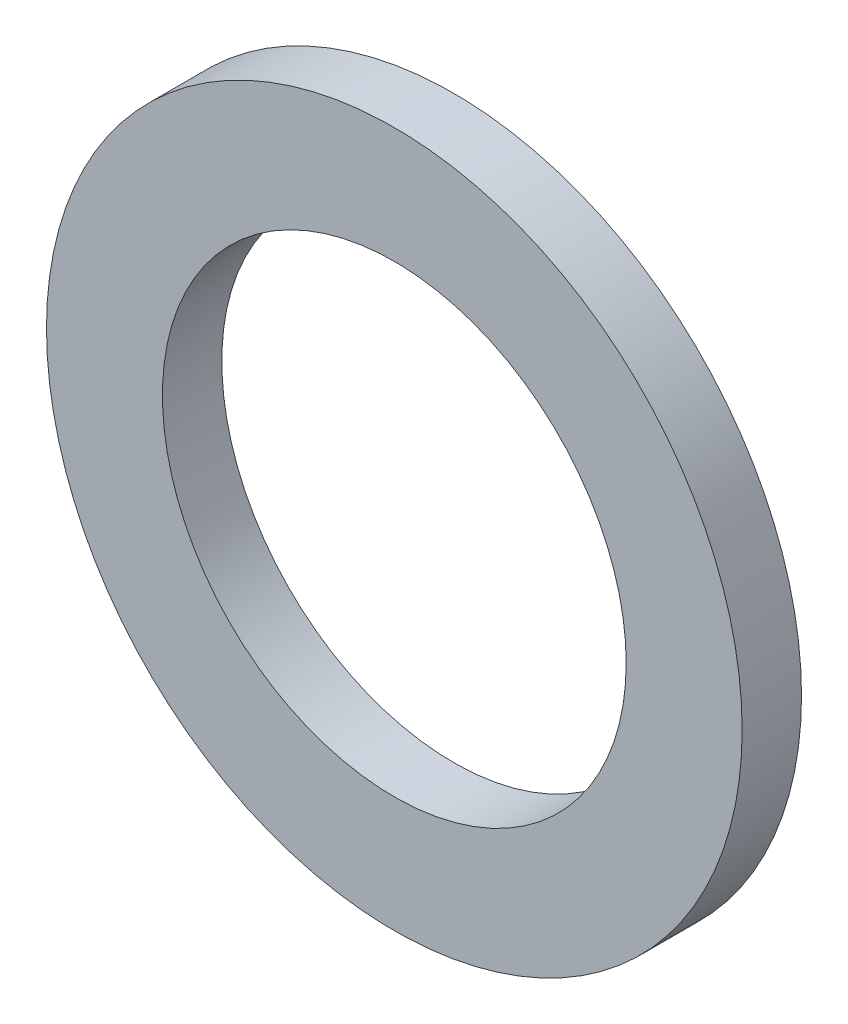
ISO-10303-21;
HEADER;
FILE_DESCRIPTION(('STEP AP214'),'2;1');
FILE_NAME('part.step','',(''),(''),'','','');
FILE_SCHEMA(('AUTOMOTIVE_DESIGN { 1 0 10303 214 1 1 1 1 }'));
ENDSEC;
DATA;
#1=APPLICATION_CONTEXT('core data for automotive mechanical design processes');
#2=APPLICATION_PROTOCOL_DEFINITION('international standard','automotive_design',2000,#1);
#3=PRODUCT_CONTEXT('',#1,'mechanical');
#4=PRODUCT('Part','Part','',(#3));
#5=PRODUCT_RELATED_PRODUCT_CATEGORY('part','',(#4));
#6=PRODUCT_DEFINITION_FORMATION('','',#4);
#7=PRODUCT_DEFINITION_CONTEXT('part definition',#1,'design');
#8=PRODUCT_DEFINITION('design','',#6,#7);
#9=PRODUCT_DEFINITION_SHAPE('','',#8);
#10=(LENGTH_UNIT() NAMED_UNIT(*) SI_UNIT(.MILLI.,.METRE.));
#11=(NAMED_UNIT(*) PLANE_ANGLE_UNIT() SI_UNIT($,.RADIAN.));
#12=(NAMED_UNIT(*) SI_UNIT($,.STERADIAN.) SOLID_ANGLE_UNIT());
#13=UNCERTAINTY_MEASURE_WITH_UNIT(LENGTH_MEASURE(1.E-05),#10,'distance_accuracy_value','');
#14=(GEOMETRIC_REPRESENTATION_CONTEXT(3) GLOBAL_UNCERTAINTY_ASSIGNED_CONTEXT((#13)) GLOBAL_UNIT_ASSIGNED_CONTEXT((#10,
#11,#12)) REPRESENTATION_CONTEXT('',''));
#15=CARTESIAN_POINT('',(0.,0.,0.));
#16=DIRECTION('',(0.,0.,1.));
#17=DIRECTION('',(1.,0.,0.));
#18=AXIS2_PLACEMENT_3D('',#15,#16,#17);
#19=CARTESIAN_POINT('',(0.,0.,0.2032));
#20=DIRECTION('',(0.,0.,1.));
#21=DIRECTION('',(1.,0.,0.));
#22=AXIS2_PLACEMENT_3D('',#19,#20,#21);
#23=PLANE('',#22);
#24=CARTESIAN_POINT('',(0.,0.,0.2032));
#25=DIRECTION('',(0.,0.,1.));
#26=DIRECTION('',(1.,0.,0.));
#27=AXIS2_PLACEMENT_3D('',#24,#25,#26);
#28=CIRCLE('',#27,2.38125);
#29=CARTESIAN_POINT('',(2.38125,0.,0.2032));
#30=VERTEX_POINT('',#29);
#31=EDGE_CURVE('E10',#30,#30,#28,.T.);
#32=ORIENTED_EDGE('',*,*,#31,.T.);
#33=EDGE_LOOP('',(#32));
#34=FACE_BOUND('',#33,.T.);
#35=CARTESIAN_POINT('',(0.,0.,0.2032));
#36=DIRECTION('',(0.,0.,1.));
#37=DIRECTION('',(1.,0.,0.));
#38=AXIS2_PLACEMENT_3D('',#35,#36,#37);
#39=CIRCLE('',#38,1.5875);
#40=CARTESIAN_POINT('',(1.5875,0.,0.2032));
#41=VERTEX_POINT('',#40);
#42=EDGE_CURVE('E46',#41,#41,#39,.T.);
#43=ORIENTED_EDGE('',*,*,#42,.F.);
#44=EDGE_LOOP('',(#43));
#45=FACE_BOUND('',#44,.T.);
#46=ADVANCED_FACE('F35',(#34,#45),#23,.T.);
#47=CARTESIAN_POINT('',(0.,0.,-0.2032));
#48=DIRECTION('',(0.,0.,1.));
#49=DIRECTION('',(1.,0.,0.));
#50=AXIS2_PLACEMENT_3D('',#47,#48,#49);
#51=PLANE('',#50);
#52=CARTESIAN_POINT('',(0.,0.,-0.2032));
#53=DIRECTION('',(0.,0.,1.));
#54=DIRECTION('',(1.,0.,0.));
#55=AXIS2_PLACEMENT_3D('',#52,#53,#54);
#56=CIRCLE('',#55,2.38125);
#57=CARTESIAN_POINT('',(2.38125,0.,-0.2032));
#58=VERTEX_POINT('',#57);
#59=EDGE_CURVE('E39',#58,#58,#56,.T.);
#60=ORIENTED_EDGE('',*,*,#59,.F.);
#61=EDGE_LOOP('',(#60));
#62=FACE_BOUND('',#61,.T.);
#63=CARTESIAN_POINT('',(0.,0.,-0.2032));
#64=DIRECTION('',(0.,0.,1.));
#65=DIRECTION('',(1.,0.,0.));
#66=AXIS2_PLACEMENT_3D('',#63,#64,#65);
#67=CIRCLE('',#66,1.5875);
#68=CARTESIAN_POINT('',(1.5875,0.,-0.2032));
#69=VERTEX_POINT('',#68);
#70=EDGE_CURVE('E48',#69,#69,#67,.T.);
#71=ORIENTED_EDGE('',*,*,#70,.T.);
#72=EDGE_LOOP('',(#71));
#73=FACE_BOUND('',#72,.T.);
#74=ADVANCED_FACE('F58',(#62,#73),#51,.F.);
#75=CARTESIAN_POINT('',(0.,0.,0.2032));
#76=DIRECTION('',(0.,0.,-1.));
#77=DIRECTION('',(-1.,0.,0.));
#78=AXIS2_PLACEMENT_3D('',#75,#76,#77);
#79=CYLINDRICAL_SURFACE('',#78,2.38125);
#80=ORIENTED_EDGE('',*,*,#31,.F.);
#81=EDGE_LOOP('',(#80));
#82=FACE_BOUND('',#81,.T.);
#83=ORIENTED_EDGE('',*,*,#59,.T.);
#84=EDGE_LOOP('',(#83));
#85=FACE_BOUND('',#84,.T.);
#86=ADVANCED_FACE('F37',(#82,#85),#79,.T.);
#87=CARTESIAN_POINT('',(0.,0.,0.2032));
#88=DIRECTION('',(0.,0.,-1.));
#89=DIRECTION('',(-1.,0.,0.));
#90=AXIS2_PLACEMENT_3D('',#87,#88,#89);
#91=CYLINDRICAL_SURFACE('',#90,1.5875);
#92=ORIENTED_EDGE('',*,*,#42,.T.);
#93=EDGE_LOOP('',(#92));
#94=FACE_BOUND('',#93,.T.);
#95=ORIENTED_EDGE('',*,*,#70,.F.);
#96=EDGE_LOOP('',(#95));
#97=FACE_BOUND('',#96,.T.);
#98=ADVANCED_FACE('F54',(#94,#97),#91,.F.);
#99=CLOSED_SHELL('',(#46,#74,#86,#98));
#100=MANIFOLD_SOLID_BREP('B2',#99);
#101=ADVANCED_BREP_SHAPE_REPRESENTATION('',(#18,#100),#14);
#102=SHAPE_DEFINITION_REPRESENTATION(#9,#101);
ENDSEC;
END-ISO-10303-21;
